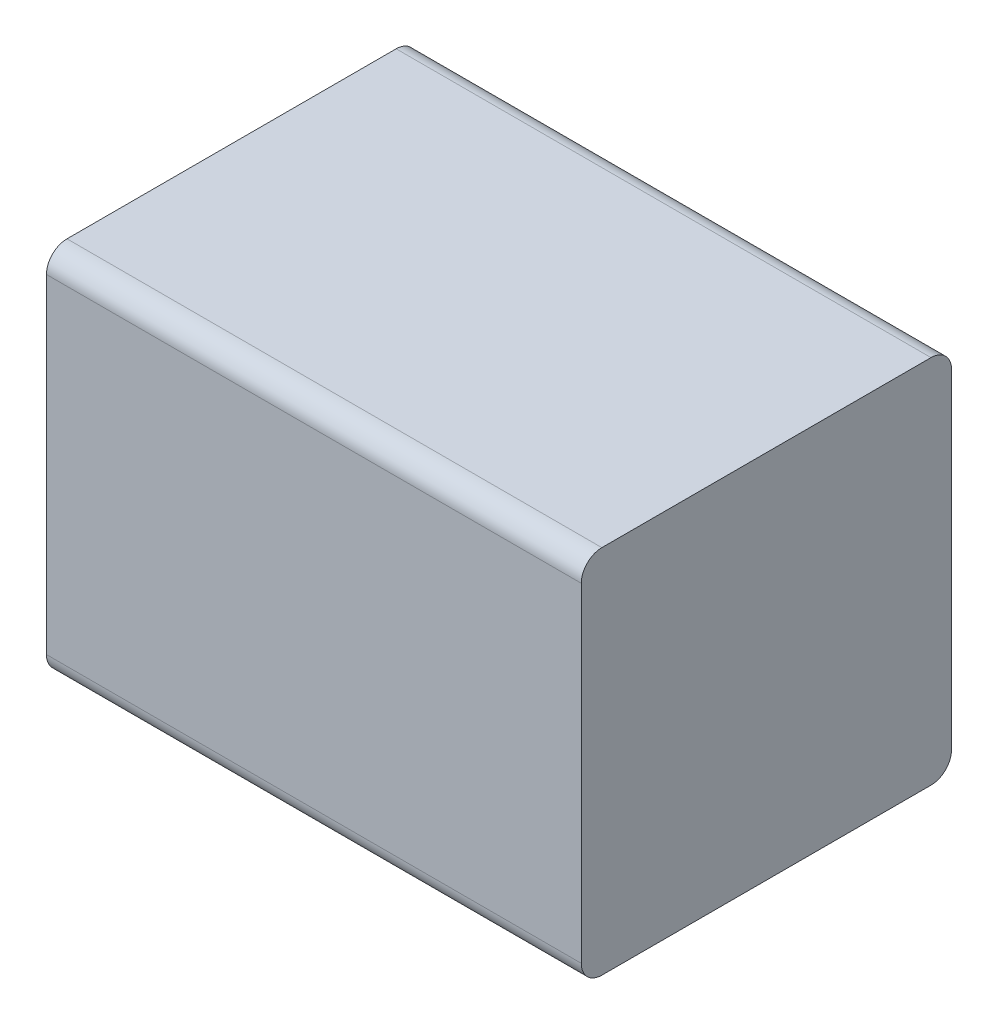
ISO-10303-21;
HEADER;
FILE_DESCRIPTION(('STEP AP214'),'2;1');
FILE_NAME('part.step','',(''),(''),'','','');
FILE_SCHEMA(('AUTOMOTIVE_DESIGN { 1 0 10303 214 1 1 1 1 }'));
ENDSEC;
DATA;
#1=APPLICATION_CONTEXT('core data for automotive mechanical design processes');
#2=APPLICATION_PROTOCOL_DEFINITION('international standard','automotive_design',2000,#1);
#3=PRODUCT_CONTEXT('',#1,'mechanical');
#4=PRODUCT('Part','Part','',(#3));
#5=PRODUCT_RELATED_PRODUCT_CATEGORY('part','',(#4));
#6=PRODUCT_DEFINITION_FORMATION('','',#4);
#7=PRODUCT_DEFINITION_CONTEXT('part definition',#1,'design');
#8=PRODUCT_DEFINITION('design','',#6,#7);
#9=PRODUCT_DEFINITION_SHAPE('','',#8);
#10=(LENGTH_UNIT() NAMED_UNIT(*) SI_UNIT(.MILLI.,.METRE.));
#11=(NAMED_UNIT(*) PLANE_ANGLE_UNIT() SI_UNIT($,.RADIAN.));
#12=(NAMED_UNIT(*) SI_UNIT($,.STERADIAN.) SOLID_ANGLE_UNIT());
#13=UNCERTAINTY_MEASURE_WITH_UNIT(LENGTH_MEASURE(1.E-05),#10,'distance_accuracy_value','');
#14=(GEOMETRIC_REPRESENTATION_CONTEXT(3) GLOBAL_UNCERTAINTY_ASSIGNED_CONTEXT((#13)) GLOBAL_UNIT_ASSIGNED_CONTEXT((#10,
#11,#12)) REPRESENTATION_CONTEXT('',''));
#15=CARTESIAN_POINT('',(0.,0.,0.));
#16=DIRECTION('',(0.,0.,1.));
#17=DIRECTION('',(1.,0.,0.));
#18=AXIS2_PLACEMENT_3D('',#15,#16,#17);
#19=CARTESIAN_POINT('',(0.,0.,0.));
#20=DIRECTION('',(0.,0.,1.));
#21=DIRECTION('',(1.,0.,0.));
#22=AXIS2_PLACEMENT_3D('',#19,#20,#21);
#23=PLANE('',#22);
#24=DIRECTION('',(0.,1.,0.));
#25=VECTOR('',#24,1.);
#26=CARTESIAN_POINT('',(1.5,0.,0.));
#27=LINE('',#26,#25);
#28=CARTESIAN_POINT('',(1.5,0.05,0.));
#29=VERTEX_POINT('',#28);
#30=CARTESIAN_POINT('',(1.5,0.85,0.));
#31=VERTEX_POINT('',#30);
#32=EDGE_CURVE('E131',#29,#31,#27,.T.);
#33=ORIENTED_EDGE('',*,*,#32,.F.);
#34=DIRECTION('',(1.,0.,0.));
#35=VECTOR('',#34,1.);
#36=CARTESIAN_POINT('',(0.,0.05,0.));
#37=LINE('',#36,#35);
#38=CARTESIAN_POINT('',(0.2,0.05,0.));
#39=VERTEX_POINT('',#38);
#40=EDGE_CURVE('E89',#39,#29,#37,.T.);
#41=ORIENTED_EDGE('',*,*,#40,.F.);
#42=DIRECTION('',(0.,1.,0.));
#43=VECTOR('',#42,1.);
#44=CARTESIAN_POINT('',(0.2,0.,0.));
#45=LINE('',#44,#43);
#46=CARTESIAN_POINT('',(0.2,0.85,0.));
#47=VERTEX_POINT('',#46);
#48=EDGE_CURVE('E86',#39,#47,#45,.T.);
#49=ORIENTED_EDGE('',*,*,#48,.T.);
#50=DIRECTION('',(1.,0.,0.));
#51=VECTOR('',#50,1.);
#52=CARTESIAN_POINT('',(0.,0.85,0.));
#53=LINE('',#52,#51);
#54=EDGE_CURVE('E123',#31,#47,#53,.F.);
#55=ORIENTED_EDGE('',*,*,#54,.F.);
#56=EDGE_LOOP('',(#33,#41,#49,#55));
#57=FACE_BOUND('',#56,.T.);
#58=ADVANCED_FACE('F17',(#57),#23,.F.);
#59=CARTESIAN_POINT('',(0.,0.85,0.05));
#60=DIRECTION('',(1.,0.,0.));
#61=DIRECTION('',(0.,0.,-1.));
#62=AXIS2_PLACEMENT_3D('',#59,#60,#61);
#63=CYLINDRICAL_SURFACE('',#62,0.05);
#64=ORIENTED_EDGE('',*,*,#54,.T.);
#65=CARTESIAN_POINT('',(0.2,0.85,0.05));
#66=DIRECTION('',(1.,0.,0.));
#67=DIRECTION('',(0.,0.,-1.));
#68=AXIS2_PLACEMENT_3D('',#65,#66,#67);
#69=CIRCLE('',#68,0.05);
#70=CARTESIAN_POINT('',(0.2,0.9,0.05));
#71=VERTEX_POINT('',#70);
#72=EDGE_CURVE('E113',#47,#71,#69,.T.);
#73=ORIENTED_EDGE('',*,*,#72,.T.);
#74=DIRECTION('',(1.,0.,0.));
#75=VECTOR('',#74,1.);
#76=CARTESIAN_POINT('',(0.,0.9,0.05));
#77=LINE('',#76,#75);
#78=CARTESIAN_POINT('',(1.5,0.9,0.05));
#79=VERTEX_POINT('',#78);
#80=EDGE_CURVE('E121',#79,#71,#77,.F.);
#81=ORIENTED_EDGE('',*,*,#80,.F.);
#82=CARTESIAN_POINT('',(1.5,0.85,0.05));
#83=DIRECTION('',(1.,0.,0.));
#84=DIRECTION('',(0.,0.,-1.));
#85=AXIS2_PLACEMENT_3D('',#82,#83,#84);
#86=CIRCLE('',#85,0.05);
#87=EDGE_CURVE('E129',#31,#79,#86,.T.);
#88=ORIENTED_EDGE('',*,*,#87,.F.);
#89=EDGE_LOOP('',(#64,#73,#81,#88));
#90=FACE_BOUND('',#89,.T.);
#91=ADVANCED_FACE('F138',(#90),#63,.T.);
#92=CARTESIAN_POINT('',(0.,0.9,0.));
#93=DIRECTION('',(0.,1.,0.));
#94=DIRECTION('',(0.,0.,1.));
#95=AXIS2_PLACEMENT_3D('',#92,#93,#94);
#96=PLANE('',#95);
#97=DIRECTION('',(1.,0.,0.));
#98=VECTOR('',#97,1.);
#99=CARTESIAN_POINT('',(0.,0.9,0.85));
#100=LINE('',#99,#98);
#101=CARTESIAN_POINT('',(1.5,0.9,0.85));
#102=VERTEX_POINT('',#101);
#103=CARTESIAN_POINT('',(0.2,0.9,0.85));
#104=VERTEX_POINT('',#103);
#105=EDGE_CURVE('E119',#102,#104,#100,.F.);
#106=ORIENTED_EDGE('',*,*,#105,.F.);
#107=DIRECTION('',(0.,0.,-1.));
#108=VECTOR('',#107,1.);
#109=CARTESIAN_POINT('',(1.5,0.9,0.));
#110=LINE('',#109,#108);
#111=EDGE_CURVE('E128',#79,#102,#110,.F.);
#112=ORIENTED_EDGE('',*,*,#111,.F.);
#113=ORIENTED_EDGE('',*,*,#80,.T.);
#114=DIRECTION('',(0.,0.,-1.));
#115=VECTOR('',#114,1.);
#116=CARTESIAN_POINT('',(0.2,0.9,0.));
#117=LINE('',#116,#115);
#118=EDGE_CURVE('E110',#71,#104,#117,.F.);
#119=ORIENTED_EDGE('',*,*,#118,.T.);
#120=EDGE_LOOP('',(#106,#112,#113,#119));
#121=FACE_BOUND('',#120,.T.);
#122=ADVANCED_FACE('F163',(#121),#96,.T.);
#123=CARTESIAN_POINT('',(0.,0.85,0.85));
#124=DIRECTION('',(1.,0.,0.));
#125=DIRECTION('',(0.,0.,-1.));
#126=AXIS2_PLACEMENT_3D('',#123,#124,#125);
#127=CYLINDRICAL_SURFACE('',#126,0.05);
#128=DIRECTION('',(1.,0.,0.));
#129=VECTOR('',#128,1.);
#130=CARTESIAN_POINT('',(0.,0.85,0.9));
#131=LINE('',#130,#129);
#132=CARTESIAN_POINT('',(1.5,0.85,0.9));
#133=VERTEX_POINT('',#132);
#134=CARTESIAN_POINT('',(0.2,0.85,0.9));
#135=VERTEX_POINT('',#134);
#136=EDGE_CURVE('E117',#133,#135,#131,.F.);
#137=ORIENTED_EDGE('',*,*,#136,.F.);
#138=CARTESIAN_POINT('',(1.5,0.85,0.85));
#139=DIRECTION('',(1.,0.,0.));
#140=DIRECTION('',(0.,0.,-1.));
#141=AXIS2_PLACEMENT_3D('',#138,#139,#140);
#142=CIRCLE('',#141,0.05);
#143=EDGE_CURVE('E126',#102,#133,#142,.T.);
#144=ORIENTED_EDGE('',*,*,#143,.F.);
#145=ORIENTED_EDGE('',*,*,#105,.T.);
#146=CARTESIAN_POINT('',(0.2,0.85,0.85));
#147=DIRECTION('',(1.,0.,0.));
#148=DIRECTION('',(0.,0.,-1.));
#149=AXIS2_PLACEMENT_3D('',#146,#147,#148);
#150=CIRCLE('',#149,0.05);
#151=EDGE_CURVE('E109',#104,#135,#150,.T.);
#152=ORIENTED_EDGE('',*,*,#151,.T.);
#153=EDGE_LOOP('',(#137,#144,#145,#152));
#154=FACE_BOUND('',#153,.T.);
#155=ADVANCED_FACE('F160',(#154),#127,.T.);
#156=CARTESIAN_POINT('',(0.,0.,0.9));
#157=DIRECTION('',(0.,0.,1.));
#158=DIRECTION('',(1.,0.,0.));
#159=AXIS2_PLACEMENT_3D('',#156,#157,#158);
#160=PLANE('',#159);
#161=DIRECTION('',(0.,1.,0.));
#162=VECTOR('',#161,1.);
#163=CARTESIAN_POINT('',(1.5,0.,0.9));
#164=LINE('',#163,#162);
#165=CARTESIAN_POINT('',(1.5,0.05,0.9));
#166=VERTEX_POINT('',#165);
#167=EDGE_CURVE('E101',#133,#166,#164,.F.);
#168=ORIENTED_EDGE('',*,*,#167,.F.);
#169=ORIENTED_EDGE('',*,*,#136,.T.);
#170=DIRECTION('',(0.,1.,0.));
#171=VECTOR('',#170,1.);
#172=CARTESIAN_POINT('',(0.2,0.,0.9));
#173=LINE('',#172,#171);
#174=CARTESIAN_POINT('',(0.2,0.05,0.9));
#175=VERTEX_POINT('',#174);
#176=EDGE_CURVE('E105',#135,#175,#173,.F.);
#177=ORIENTED_EDGE('',*,*,#176,.T.);
#178=DIRECTION('',(1.,0.,0.));
#179=VECTOR('',#178,1.);
#180=CARTESIAN_POINT('',(0.,0.05,0.9));
#181=LINE('',#180,#179);
#182=EDGE_CURVE('E108',#166,#175,#181,.F.);
#183=ORIENTED_EDGE('',*,*,#182,.F.);
#184=EDGE_LOOP('',(#168,#169,#177,#183));
#185=FACE_BOUND('',#184,.T.);
#186=ADVANCED_FACE('F158',(#185),#160,.T.);
#187=CARTESIAN_POINT('',(0.,0.05,0.05));
#188=DIRECTION('',(1.,0.,0.));
#189=DIRECTION('',(0.,0.,-1.));
#190=AXIS2_PLACEMENT_3D('',#187,#188,#189);
#191=CYLINDRICAL_SURFACE('',#190,0.05);
#192=ORIENTED_EDGE('',*,*,#40,.T.);
#193=CARTESIAN_POINT('',(1.5,0.05,0.05));
#194=DIRECTION('',(1.,0.,0.));
#195=DIRECTION('',(0.,0.,-1.));
#196=AXIS2_PLACEMENT_3D('',#193,#194,#195);
#197=CIRCLE('',#196,0.05);
#198=CARTESIAN_POINT('',(1.5,0.,0.05));
#199=VERTEX_POINT('',#198);
#200=EDGE_CURVE('E99',#199,#29,#197,.T.);
#201=ORIENTED_EDGE('',*,*,#200,.F.);
#202=DIRECTION('',(1.,0.,0.));
#203=VECTOR('',#202,1.);
#204=CARTESIAN_POINT('',(0.,0.,0.05));
#205=LINE('',#204,#203);
#206=CARTESIAN_POINT('',(0.2,0.,0.05));
#207=VERTEX_POINT('',#206);
#208=EDGE_CURVE('E93',#199,#207,#205,.F.);
#209=ORIENTED_EDGE('',*,*,#208,.T.);
#210=CARTESIAN_POINT('',(0.2,0.05,0.05));
#211=DIRECTION('',(1.,0.,0.));
#212=DIRECTION('',(0.,0.,-1.));
#213=AXIS2_PLACEMENT_3D('',#210,#211,#212);
#214=CIRCLE('',#213,0.05);
#215=EDGE_CURVE('E20',#207,#39,#214,.T.);
#216=ORIENTED_EDGE('',*,*,#215,.T.);
#217=EDGE_LOOP('',(#192,#201,#209,#216));
#218=FACE_BOUND('',#217,.T.);
#219=ADVANCED_FACE('F97',(#218),#191,.T.);
#220=CARTESIAN_POINT('',(0.2,0.,0.));
#221=DIRECTION('',(1.,0.,0.));
#222=DIRECTION('',(0.,0.,-1.));
#223=AXIS2_PLACEMENT_3D('',#220,#221,#222);
#224=PLANE('',#223);
#225=ORIENTED_EDGE('',*,*,#176,.F.);
#226=ORIENTED_EDGE('',*,*,#151,.F.);
#227=ORIENTED_EDGE('',*,*,#118,.F.);
#228=ORIENTED_EDGE('',*,*,#72,.F.);
#229=ORIENTED_EDGE('',*,*,#48,.F.);
#230=ORIENTED_EDGE('',*,*,#215,.F.);
#231=DIRECTION('',(0.,0.,1.));
#232=VECTOR('',#231,1.);
#233=CARTESIAN_POINT('',(0.2,0.,0.));
#234=LINE('',#233,#232);
#235=CARTESIAN_POINT('',(0.2,0.,0.85));
#236=VERTEX_POINT('',#235);
#237=EDGE_CURVE('E83',#207,#236,#234,.T.);
#238=ORIENTED_EDGE('',*,*,#237,.T.);
#239=CARTESIAN_POINT('',(0.2,0.05,0.85));
#240=DIRECTION('',(1.,0.,0.));
#241=DIRECTION('',(0.,0.,-1.));
#242=AXIS2_PLACEMENT_3D('',#239,#240,#241);
#243=CIRCLE('',#242,0.05);
#244=EDGE_CURVE('E116',#175,#236,#243,.T.);
#245=ORIENTED_EDGE('',*,*,#244,.F.);
#246=EDGE_LOOP('',(#225,#226,#227,#228,#229,#230,#238,#245));
#247=FACE_BOUND('',#246,.T.);
#248=ADVANCED_FACE('F81',(#247),#224,.F.);
#249=CARTESIAN_POINT('',(0.,0.05,0.85));
#250=DIRECTION('',(1.,0.,0.));
#251=DIRECTION('',(0.,0.,-1.));
#252=AXIS2_PLACEMENT_3D('',#249,#250,#251);
#253=CYLINDRICAL_SURFACE('',#252,0.05);
#254=ORIENTED_EDGE('',*,*,#182,.T.);
#255=ORIENTED_EDGE('',*,*,#244,.T.);
#256=DIRECTION('',(1.,0.,0.));
#257=VECTOR('',#256,1.);
#258=CARTESIAN_POINT('',(0.,0.,0.85));
#259=LINE('',#258,#257);
#260=CARTESIAN_POINT('',(1.5,0.,0.85));
#261=VERTEX_POINT('',#260);
#262=EDGE_CURVE('E26',#236,#261,#259,.T.);
#263=ORIENTED_EDGE('',*,*,#262,.T.);
#264=CARTESIAN_POINT('',(1.5,0.05,0.85));
#265=DIRECTION('',(1.,0.,0.));
#266=DIRECTION('',(0.,0.,-1.));
#267=AXIS2_PLACEMENT_3D('',#264,#265,#266);
#268=CIRCLE('',#267,0.05);
#269=EDGE_CURVE('E34',#166,#261,#268,.T.);
#270=ORIENTED_EDGE('',*,*,#269,.F.);
#271=EDGE_LOOP('',(#254,#255,#263,#270));
#272=FACE_BOUND('',#271,.T.);
#273=ADVANCED_FACE('F149',(#272),#253,.T.);
#274=CARTESIAN_POINT('',(1.5,0.,0.));
#275=DIRECTION('',(1.,0.,0.));
#276=DIRECTION('',(0.,0.,-1.));
#277=AXIS2_PLACEMENT_3D('',#274,#275,#276);
#278=PLANE('',#277);
#279=ORIENTED_EDGE('',*,*,#167,.T.);
#280=ORIENTED_EDGE('',*,*,#269,.T.);
#281=DIRECTION('',(0.,0.,1.));
#282=VECTOR('',#281,1.);
#283=CARTESIAN_POINT('',(1.5,0.,0.));
#284=LINE('',#283,#282);
#285=EDGE_CURVE('E11',#261,#199,#284,.F.);
#286=ORIENTED_EDGE('',*,*,#285,.T.);
#287=ORIENTED_EDGE('',*,*,#200,.T.);
#288=ORIENTED_EDGE('',*,*,#32,.T.);
#289=ORIENTED_EDGE('',*,*,#87,.T.);
#290=ORIENTED_EDGE('',*,*,#111,.T.);
#291=ORIENTED_EDGE('',*,*,#143,.T.);
#292=EDGE_LOOP('',(#279,#280,#286,#287,#288,#289,#290,#291));
#293=FACE_BOUND('',#292,.T.);
#294=ADVANCED_FACE('F147',(#293),#278,.T.);
#295=CARTESIAN_POINT('',(0.,0.,0.));
#296=DIRECTION('',(0.,1.,0.));
#297=DIRECTION('',(0.,0.,1.));
#298=AXIS2_PLACEMENT_3D('',#295,#296,#297);
#299=PLANE('',#298);
#300=ORIENTED_EDGE('',*,*,#262,.F.);
#301=ORIENTED_EDGE('',*,*,#237,.F.);
#302=ORIENTED_EDGE('',*,*,#208,.F.);
#303=ORIENTED_EDGE('',*,*,#285,.F.);
#304=EDGE_LOOP('',(#300,#301,#302,#303));
#305=FACE_BOUND('',#304,.T.);
#306=ADVANCED_FACE('F92',(#305),#299,.F.);
#307=CLOSED_SHELL('',(#58,#91,#122,#155,#186,#219,#248,#273,#294,#306));
#308=MANIFOLD_SOLID_BREP('B1',#307);
#309=ADVANCED_BREP_SHAPE_REPRESENTATION('',(#18,#308),#14);
#310=SHAPE_DEFINITION_REPRESENTATION(#9,#309);
ENDSEC;
END-ISO-10303-21;
